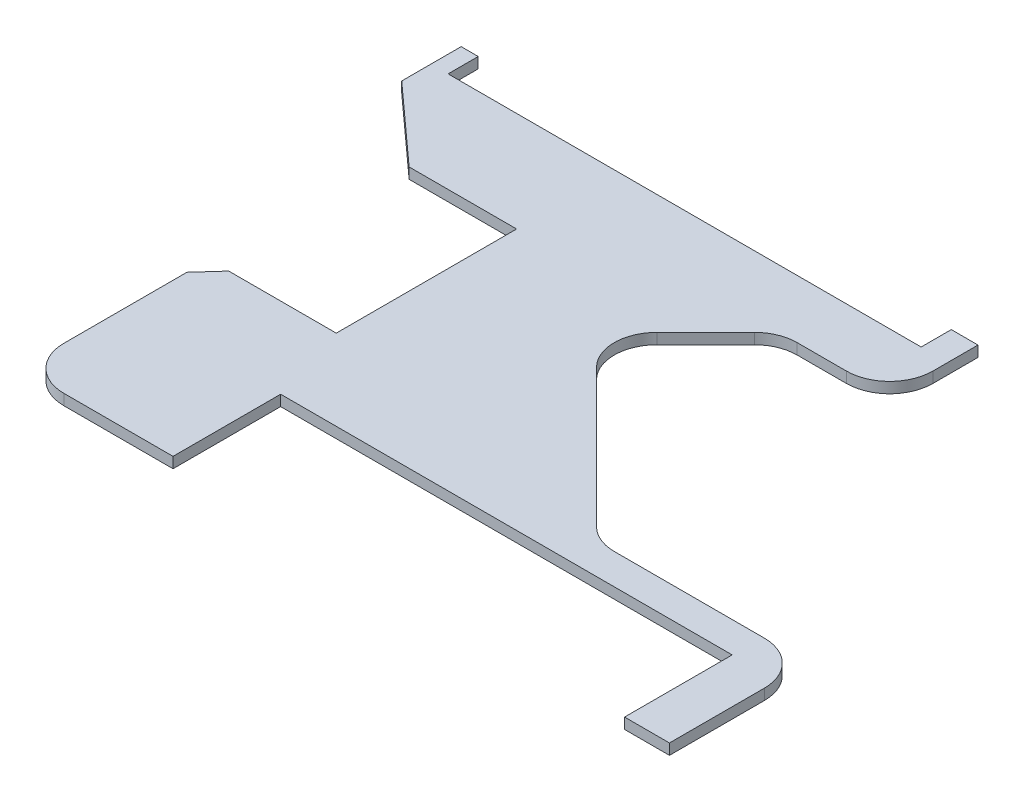
ISO-10303-21;
HEADER;
FILE_DESCRIPTION(('STEP AP214'),'2;1');
FILE_NAME('part.step','',(''),(''),'','','');
FILE_SCHEMA(('AUTOMOTIVE_DESIGN { 1 0 10303 214 1 1 1 1 }'));
ENDSEC;
DATA;
#1=APPLICATION_CONTEXT('core data for automotive mechanical design processes');
#2=APPLICATION_PROTOCOL_DEFINITION('international standard','automotive_design',2000,#1);
#3=PRODUCT_CONTEXT('',#1,'mechanical');
#4=PRODUCT('Part','Part','',(#3));
#5=PRODUCT_RELATED_PRODUCT_CATEGORY('part','',(#4));
#6=PRODUCT_DEFINITION_FORMATION('','',#4);
#7=PRODUCT_DEFINITION_CONTEXT('part definition',#1,'design');
#8=PRODUCT_DEFINITION('design','',#6,#7);
#9=PRODUCT_DEFINITION_SHAPE('','',#8);
#10=(LENGTH_UNIT() NAMED_UNIT(*) SI_UNIT(.MILLI.,.METRE.));
#11=(NAMED_UNIT(*) PLANE_ANGLE_UNIT() SI_UNIT($,.RADIAN.));
#12=(NAMED_UNIT(*) SI_UNIT($,.STERADIAN.) SOLID_ANGLE_UNIT());
#13=UNCERTAINTY_MEASURE_WITH_UNIT(LENGTH_MEASURE(1.E-05),#10,'distance_accuracy_value','');
#14=(GEOMETRIC_REPRESENTATION_CONTEXT(3) GLOBAL_UNCERTAINTY_ASSIGNED_CONTEXT((#13)) GLOBAL_UNIT_ASSIGNED_CONTEXT((#10,
#11,#12)) REPRESENTATION_CONTEXT('',''));
#15=CARTESIAN_POINT('',(0.,0.,0.));
#16=DIRECTION('',(0.,0.,1.));
#17=DIRECTION('',(1.,0.,0.));
#18=AXIS2_PLACEMENT_3D('',#15,#16,#17);
#19=CARTESIAN_POINT('',(-149.633756095351,6.35,-116.560985612658));
#20=DIRECTION('',(0.671096805724453,0.,-0.74136973053021));
#21=DIRECTION('',(-0.74136973053021,0.,-0.671096805724453));
#22=AXIS2_PLACEMENT_3D('',#19,#20,#21);
#23=PLANE('',#22);
#24=DIRECTION('',(0.74136973053021,0.,0.671096805724453));
#25=VECTOR('',#24,1.);
#26=CARTESIAN_POINT('',(-149.633756095351,0.,-116.560985612658));
#27=LINE('',#26,#25);
#28=CARTESIAN_POINT('',(-149.633756095351,0.,-116.560985612658));
#29=VERTEX_POINT('',#28);
#30=CARTESIAN_POINT('',(-103.503143824412,0.,-74.803));
#31=VERTEX_POINT('',#30);
#32=EDGE_CURVE('E255',#29,#31,#27,.T.);
#33=ORIENTED_EDGE('',*,*,#32,.T.);
#34=DIRECTION('',(0.,-1.,0.));
#35=VECTOR('',#34,1.);
#36=CARTESIAN_POINT('',(-103.503143824412,6.35,-74.803));
#37=LINE('',#36,#35);
#38=CARTESIAN_POINT('',(-103.503143824412,6.35,-74.803));
#39=VERTEX_POINT('',#38);
#40=EDGE_CURVE('E11',#39,#31,#37,.T.);
#41=ORIENTED_EDGE('',*,*,#40,.F.);
#42=DIRECTION('',(0.74136973053021,0.,0.671096805724453));
#43=VECTOR('',#42,1.);
#44=CARTESIAN_POINT('',(-149.633756095351,6.35,-116.560985612658));
#45=LINE('',#44,#43);
#46=CARTESIAN_POINT('',(-149.633756095351,6.35,-116.560985612658));
#47=VERTEX_POINT('',#46);
#48=EDGE_CURVE('E150',#47,#39,#45,.T.);
#49=ORIENTED_EDGE('',*,*,#48,.F.);
#50=DIRECTION('',(0.,-1.,0.));
#51=VECTOR('',#50,1.);
#52=CARTESIAN_POINT('',(-149.633756095351,6.35,-116.560985612658));
#53=LINE('',#52,#51);
#54=EDGE_CURVE('E49',#47,#29,#53,.T.);
#55=ORIENTED_EDGE('',*,*,#54,.T.);
#56=EDGE_LOOP('',(#33,#41,#49,#55));
#57=FACE_BOUND('',#56,.T.);
#58=ADVANCED_FACE('F33',(#57),#23,.F.);
#59=CARTESIAN_POINT('',(-40.0812,6.35,-74.803));
#60=DIRECTION('',(0.,0.,1.));
#61=DIRECTION('',(1.,0.,0.));
#62=AXIS2_PLACEMENT_3D('',#59,#60,#61);
#63=PLANE('',#62);
#64=DIRECTION('',(-1.,0.,0.));
#65=VECTOR('',#64,1.);
#66=CARTESIAN_POINT('',(-40.0812,0.,-74.803));
#67=LINE('',#66,#65);
#68=CARTESIAN_POINT('',(-40.0812,0.,-74.803));
#69=VERTEX_POINT('',#68);
#70=EDGE_CURVE('E257',#69,#31,#67,.T.);
#71=ORIENTED_EDGE('',*,*,#70,.F.);
#72=DIRECTION('',(0.,-1.,0.));
#73=VECTOR('',#72,1.);
#74=CARTESIAN_POINT('',(-40.0812,6.35,-74.803));
#75=LINE('',#74,#73);
#76=CARTESIAN_POINT('',(-40.0812,6.35,-74.803));
#77=VERTEX_POINT('',#76);
#78=EDGE_CURVE('E41',#77,#69,#75,.T.);
#79=ORIENTED_EDGE('',*,*,#78,.F.);
#80=DIRECTION('',(-1.,0.,0.));
#81=VECTOR('',#80,1.);
#82=CARTESIAN_POINT('',(-40.0812,6.35,-74.803));
#83=LINE('',#82,#81);
#84=EDGE_CURVE('E413',#77,#39,#83,.T.);
#85=ORIENTED_EDGE('',*,*,#84,.T.);
#86=ORIENTED_EDGE('',*,*,#40,.T.);
#87=EDGE_LOOP('',(#71,#79,#85,#86));
#88=FACE_BOUND('',#87,.T.);
#89=ADVANCED_FACE('F396',(#88),#63,.T.);
#90=CARTESIAN_POINT('',(-40.0812,6.35,0.));
#91=DIRECTION('',(1.,0.,0.));
#92=DIRECTION('',(0.,0.,-1.));
#93=AXIS2_PLACEMENT_3D('',#90,#91,#92);
#94=PLANE('',#93);
#95=DIRECTION('',(0.,0.,1.));
#96=VECTOR('',#95,1.);
#97=CARTESIAN_POINT('',(-40.0812,0.,0.));
#98=LINE('',#97,#96);
#99=CARTESIAN_POINT('',(-40.0812,0.,31.623));
#100=VERTEX_POINT('',#99);
#101=EDGE_CURVE('E260',#69,#100,#98,.T.);
#102=ORIENTED_EDGE('',*,*,#101,.T.);
#103=DIRECTION('',(0.,-1.,0.));
#104=VECTOR('',#103,1.);
#105=CARTESIAN_POINT('',(-40.0812,6.35,31.623));
#106=LINE('',#105,#104);
#107=CARTESIAN_POINT('',(-40.0812,6.35,31.623));
#108=VERTEX_POINT('',#107);
#109=EDGE_CURVE('E385',#108,#100,#106,.T.);
#110=ORIENTED_EDGE('',*,*,#109,.F.);
#111=DIRECTION('',(0.,0.,-1.));
#112=VECTOR('',#111,1.);
#113=CARTESIAN_POINT('',(-40.0812,6.35,0.));
#114=LINE('',#113,#112);
#115=EDGE_CURVE('E393',#108,#77,#114,.T.);
#116=ORIENTED_EDGE('',*,*,#115,.T.);
#117=ORIENTED_EDGE('',*,*,#78,.T.);
#118=EDGE_LOOP('',(#102,#110,#116,#117));
#119=FACE_BOUND('',#118,.T.);
#120=ADVANCED_FACE('F391',(#119),#94,.F.);
#121=CARTESIAN_POINT('',(-40.0812,6.35,31.623));
#122=DIRECTION('',(0.,0.,1.));
#123=DIRECTION('',(1.,0.,0.));
#124=AXIS2_PLACEMENT_3D('',#121,#122,#123);
#125=PLANE('',#124);
#126=DIRECTION('',(-1.,0.,0.));
#127=VECTOR('',#126,1.);
#128=CARTESIAN_POINT('',(-40.0812,0.,31.623));
#129=LINE('',#128,#127);
#130=CARTESIAN_POINT('',(-103.510542610108,0.,31.623));
#131=VERTEX_POINT('',#130);
#132=EDGE_CURVE('E262',#100,#131,#129,.T.);
#133=ORIENTED_EDGE('',*,*,#132,.T.);
#134=DIRECTION('',(0.,-1.,0.));
#135=VECTOR('',#134,1.);
#136=CARTESIAN_POINT('',(-103.510542610108,6.35,31.623));
#137=LINE('',#136,#135);
#138=CARTESIAN_POINT('',(-103.510542610108,6.35,31.623));
#139=VERTEX_POINT('',#138);
#140=EDGE_CURVE('E383',#139,#131,#137,.T.);
#141=ORIENTED_EDGE('',*,*,#140,.F.);
#142=DIRECTION('',(-1.,0.,0.));
#143=VECTOR('',#142,1.);
#144=CARTESIAN_POINT('',(-40.0812,6.35,31.623));
#145=LINE('',#144,#143);
#146=EDGE_CURVE('E407',#108,#139,#145,.T.);
#147=ORIENTED_EDGE('',*,*,#146,.F.);
#148=ORIENTED_EDGE('',*,*,#109,.T.);
#149=EDGE_LOOP('',(#133,#141,#147,#148));
#150=FACE_BOUND('',#149,.T.);
#151=ADVANCED_FACE('F404',(#150),#125,.F.);
#152=CARTESIAN_POINT('',(-115.248716587259,6.35,44.5903197728351));
#153=DIRECTION('',(-0.741369730530207,0.,-0.671096805724455));
#154=DIRECTION('',(-0.671096805724456,0.,0.741369730530207));
#155=AXIS2_PLACEMENT_3D('',#152,#153,#154);
#156=PLANE('',#155);
#157=DIRECTION('',(0.671096805724456,0.,-0.741369730530207));
#158=VECTOR('',#157,1.);
#159=CARTESIAN_POINT('',(-115.248716587259,0.,44.5903197728351));
#160=LINE('',#159,#158);
#161=CARTESIAN_POINT('',(-115.248716587259,0.,44.5903197728351));
#162=VERTEX_POINT('',#161);
#163=EDGE_CURVE('E265',#162,#131,#160,.T.);
#164=ORIENTED_EDGE('',*,*,#163,.F.);
#165=DIRECTION('',(0.,-1.,0.));
#166=VECTOR('',#165,1.);
#167=CARTESIAN_POINT('',(-115.248716587259,6.35,44.5903197728351));
#168=LINE('',#167,#166);
#169=CARTESIAN_POINT('',(-115.248716587259,6.35,44.5903197728351));
#170=VERTEX_POINT('',#169);
#171=EDGE_CURVE('E381',#170,#162,#168,.T.);
#172=ORIENTED_EDGE('',*,*,#171,.F.);
#173=DIRECTION('',(0.671096805724456,0.,-0.741369730530207));
#174=VECTOR('',#173,1.);
#175=CARTESIAN_POINT('',(-115.248716587259,6.35,44.5903197728351));
#176=LINE('',#175,#174);
#177=EDGE_CURVE('E409',#170,#139,#176,.T.);
#178=ORIENTED_EDGE('',*,*,#177,.T.);
#179=ORIENTED_EDGE('',*,*,#140,.T.);
#180=EDGE_LOOP('',(#164,#172,#178,#179));
#181=FACE_BOUND('',#180,.T.);
#182=ADVANCED_FACE('F494',(#181),#156,.T.);
#183=CARTESIAN_POINT('',(-115.248716587259,6.35,44.5903197728351));
#184=DIRECTION('',(1.,0.,0.));
#185=DIRECTION('',(0.,0.,-1.));
#186=AXIS2_PLACEMENT_3D('',#183,#184,#185);
#187=PLANE('',#186);
#188=DIRECTION('',(0.,0.,1.));
#189=VECTOR('',#188,1.);
#190=CARTESIAN_POINT('',(-115.248716587259,0.,44.5903197728351));
#191=LINE('',#190,#189);
#192=CARTESIAN_POINT('',(-115.248716587259,0.,117.221));
#193=VERTEX_POINT('',#192);
#194=EDGE_CURVE('E268',#162,#193,#191,.T.);
#195=ORIENTED_EDGE('',*,*,#194,.T.);
#196=DIRECTION('',(0.,-1.,0.));
#197=VECTOR('',#196,1.);
#198=CARTESIAN_POINT('',(-115.248716587259,6.35,117.221));
#199=LINE('',#198,#197);
#200=CARTESIAN_POINT('',(-115.248716587259,6.35,117.221));
#201=VERTEX_POINT('',#200);
#202=EDGE_CURVE('E379',#201,#193,#199,.T.);
#203=ORIENTED_EDGE('',*,*,#202,.F.);
#204=DIRECTION('',(0.,0.,1.));
#205=VECTOR('',#204,1.);
#206=CARTESIAN_POINT('',(-115.248716587259,6.35,44.5903197728351));
#207=LINE('',#206,#205);
#208=EDGE_CURVE('E411',#170,#201,#207,.T.);
#209=ORIENTED_EDGE('',*,*,#208,.F.);
#210=ORIENTED_EDGE('',*,*,#171,.T.);
#211=EDGE_LOOP('',(#195,#203,#209,#210));
#212=FACE_BOUND('',#211,.T.);
#213=ADVANCED_FACE('F497',(#212),#187,.F.);
#214=CARTESIAN_POINT('',(-89.7217165872589,6.35,117.221));
#215=DIRECTION('',(0.,-1.,0.));
#216=DIRECTION('',(0.,0.,-1.));
#217=AXIS2_PLACEMENT_3D('',#214,#215,#216);
#218=CYLINDRICAL_SURFACE('',#217,25.527);
#219=CARTESIAN_POINT('',(-89.7217165872589,0.,117.221));
#220=DIRECTION('',(0.,-1.,0.));
#221=DIRECTION('',(0.,0.,-1.));
#222=AXIS2_PLACEMENT_3D('',#219,#220,#221);
#223=CIRCLE('',#222,25.527);
#224=CARTESIAN_POINT('',(-89.7217165872589,0.,142.748));
#225=VERTEX_POINT('',#224);
#226=EDGE_CURVE('E271',#225,#193,#223,.T.);
#227=ORIENTED_EDGE('',*,*,#226,.F.);
#228=DIRECTION('',(0.,-1.,0.));
#229=VECTOR('',#228,1.);
#230=CARTESIAN_POINT('',(-89.7217165872589,6.35,142.748));
#231=LINE('',#230,#229);
#232=CARTESIAN_POINT('',(-89.7217165872589,6.35,142.748));
#233=VERTEX_POINT('',#232);
#234=EDGE_CURVE('E377',#233,#225,#231,.T.);
#235=ORIENTED_EDGE('',*,*,#234,.F.);
#236=CARTESIAN_POINT('',(-89.7217165872589,6.35,117.221));
#237=DIRECTION('',(0.,-1.,0.));
#238=DIRECTION('',(0.,0.,-1.));
#239=AXIS2_PLACEMENT_3D('',#236,#237,#238);
#240=CIRCLE('',#239,25.527);
#241=EDGE_CURVE('E418',#233,#201,#240,.T.);
#242=ORIENTED_EDGE('',*,*,#241,.T.);
#243=ORIENTED_EDGE('',*,*,#202,.T.);
#244=EDGE_LOOP('',(#227,#235,#242,#243));
#245=FACE_BOUND('',#244,.T.);
#246=ADVANCED_FACE('F501',(#245),#218,.T.);
#247=CARTESIAN_POINT('',(-89.7217165872589,6.35,142.748));
#248=DIRECTION('',(0.,0.,-1.));
#249=DIRECTION('',(-1.,0.,0.));
#250=AXIS2_PLACEMENT_3D('',#247,#248,#249);
#251=PLANE('',#250);
#252=DIRECTION('',(1.,0.,0.));
#253=VECTOR('',#252,1.);
#254=CARTESIAN_POINT('',(-89.7217165872589,0.,142.748));
#255=LINE('',#254,#253);
#256=CARTESIAN_POINT('',(-25.273,0.,142.748));
#257=VERTEX_POINT('',#256);
#258=EDGE_CURVE('E274',#225,#257,#255,.T.);
#259=ORIENTED_EDGE('',*,*,#258,.T.);
#260=DIRECTION('',(0.,-1.,0.));
#261=VECTOR('',#260,1.);
#262=CARTESIAN_POINT('',(-25.273,6.35,142.748));
#263=LINE('',#262,#261);
#264=CARTESIAN_POINT('',(-25.273,6.35,142.748));
#265=VERTEX_POINT('',#264);
#266=EDGE_CURVE('E375',#265,#257,#263,.T.);
#267=ORIENTED_EDGE('',*,*,#266,.F.);
#268=DIRECTION('',(1.,0.,0.));
#269=VECTOR('',#268,1.);
#270=CARTESIAN_POINT('',(-89.7217165872589,6.35,142.748));
#271=LINE('',#270,#269);
#272=EDGE_CURVE('E421',#233,#265,#271,.T.);
#273=ORIENTED_EDGE('',*,*,#272,.F.);
#274=ORIENTED_EDGE('',*,*,#234,.T.);
#275=EDGE_LOOP('',(#259,#267,#273,#274));
#276=FACE_BOUND('',#275,.T.);
#277=ADVANCED_FACE('F505',(#276),#251,.F.);
#278=CARTESIAN_POINT('',(-25.273,6.35,79.248));
#279=DIRECTION('',(1.,0.,0.));
#280=DIRECTION('',(0.,0.,-1.));
#281=AXIS2_PLACEMENT_3D('',#278,#279,#280);
#282=PLANE('',#281);
#283=DIRECTION('',(0.,0.,1.));
#284=VECTOR('',#283,1.);
#285=CARTESIAN_POINT('',(-25.273,0.,79.248));
#286=LINE('',#285,#284);
#287=CARTESIAN_POINT('',(-25.273,0.,79.248));
#288=VERTEX_POINT('',#287);
#289=EDGE_CURVE('E277',#288,#257,#286,.T.);
#290=ORIENTED_EDGE('',*,*,#289,.F.);
#291=DIRECTION('',(0.,-1.,0.));
#292=VECTOR('',#291,1.);
#293=CARTESIAN_POINT('',(-25.273,6.35,79.248));
#294=LINE('',#293,#292);
#295=CARTESIAN_POINT('',(-25.273,6.35,79.248));
#296=VERTEX_POINT('',#295);
#297=EDGE_CURVE('E372',#296,#288,#294,.T.);
#298=ORIENTED_EDGE('',*,*,#297,.F.);
#299=DIRECTION('',(0.,0.,1.));
#300=VECTOR('',#299,1.);
#301=CARTESIAN_POINT('',(-25.273,6.35,79.248));
#302=LINE('',#301,#300);
#303=EDGE_CURVE('E423',#296,#265,#302,.T.);
#304=ORIENTED_EDGE('',*,*,#303,.T.);
#305=ORIENTED_EDGE('',*,*,#266,.T.);
#306=EDGE_LOOP('',(#290,#298,#304,#305));
#307=FACE_BOUND('',#306,.T.);
#308=ADVANCED_FACE('F509',(#307),#282,.T.);
#309=CARTESIAN_POINT('',(0.,6.35,79.248));
#310=DIRECTION('',(0.,0.,-1.));
#311=DIRECTION('',(-1.,0.,0.));
#312=AXIS2_PLACEMENT_3D('',#309,#310,#311);
#313=PLANE('',#312);
#314=DIRECTION('',(1.,0.,0.));
#315=VECTOR('',#314,1.);
#316=CARTESIAN_POINT('',(0.,0.,79.248));
#317=LINE('',#316,#315);
#318=CARTESIAN_POINT('',(241.173,0.,79.2479999999999));
#319=VERTEX_POINT('',#318);
#320=EDGE_CURVE('E280',#288,#319,#317,.T.);
#321=ORIENTED_EDGE('',*,*,#320,.T.);
#322=DIRECTION('',(0.,-1.,0.));
#323=VECTOR('',#322,1.);
#324=CARTESIAN_POINT('',(241.173,6.35,79.2479999999999));
#325=LINE('',#324,#323);
#326=CARTESIAN_POINT('',(241.173,6.35,79.2479999999999));
#327=VERTEX_POINT('',#326);
#328=EDGE_CURVE('E369',#327,#319,#325,.T.);
#329=ORIENTED_EDGE('',*,*,#328,.F.);
#330=DIRECTION('',(-1.,0.,0.));
#331=VECTOR('',#330,1.);
#332=CARTESIAN_POINT('',(0.,6.35,79.248));
#333=LINE('',#332,#331);
#334=EDGE_CURVE('E426',#327,#296,#333,.T.);
#335=ORIENTED_EDGE('',*,*,#334,.T.);
#336=ORIENTED_EDGE('',*,*,#297,.T.);
#337=EDGE_LOOP('',(#321,#329,#335,#336));
#338=FACE_BOUND('',#337,.T.);
#339=ADVANCED_FACE('F513',(#338),#313,.F.);
#340=CARTESIAN_POINT('',(241.173,6.35,79.2479999999999));
#341=DIRECTION('',(1.,0.,0.));
#342=DIRECTION('',(0.,0.,-1.));
#343=AXIS2_PLACEMENT_3D('',#340,#341,#342);
#344=PLANE('',#343);
#345=DIRECTION('',(0.,0.,1.));
#346=VECTOR('',#345,1.);
#347=CARTESIAN_POINT('',(241.173,0.,79.2479999999999));
#348=LINE('',#347,#346);
#349=CARTESIAN_POINT('',(241.173,0.,142.748));
#350=VERTEX_POINT('',#349);
#351=EDGE_CURVE('E282',#319,#350,#348,.T.);
#352=ORIENTED_EDGE('',*,*,#351,.T.);
#353=DIRECTION('',(0.,-1.,0.));
#354=VECTOR('',#353,1.);
#355=CARTESIAN_POINT('',(241.173,6.35,142.748));
#356=LINE('',#355,#354);
#357=CARTESIAN_POINT('',(241.173,6.35,142.748));
#358=VERTEX_POINT('',#357);
#359=EDGE_CURVE('E367',#358,#350,#356,.T.);
#360=ORIENTED_EDGE('',*,*,#359,.F.);
#361=DIRECTION('',(0.,0.,1.));
#362=VECTOR('',#361,1.);
#363=CARTESIAN_POINT('',(241.173,6.35,79.2479999999999));
#364=LINE('',#363,#362);
#365=EDGE_CURVE('E429',#327,#358,#364,.T.);
#366=ORIENTED_EDGE('',*,*,#365,.F.);
#367=ORIENTED_EDGE('',*,*,#328,.T.);
#368=EDGE_LOOP('',(#352,#360,#366,#367));
#369=FACE_BOUND('',#368,.T.);
#370=ADVANCED_FACE('F517',(#369),#344,.F.);
#371=CARTESIAN_POINT('',(267.652928411668,6.35,142.748));
#372=DIRECTION('',(0.,0.,1.));
#373=DIRECTION('',(1.,0.,0.));
#374=AXIS2_PLACEMENT_3D('',#371,#372,#373);
#375=PLANE('',#374);
#376=DIRECTION('',(-1.,0.,0.));
#377=VECTOR('',#376,1.);
#378=CARTESIAN_POINT('',(267.652928411668,0.,142.748));
#379=LINE('',#378,#377);
#380=CARTESIAN_POINT('',(267.652928411668,0.,142.748));
#381=VERTEX_POINT('',#380);
#382=EDGE_CURVE('E285',#381,#350,#379,.T.);
#383=ORIENTED_EDGE('',*,*,#382,.F.);
#384=DIRECTION('',(0.,-1.,0.));
#385=VECTOR('',#384,1.);
#386=CARTESIAN_POINT('',(267.652928411668,6.35,142.748));
#387=LINE('',#386,#385);
#388=CARTESIAN_POINT('',(267.652928411668,6.35,142.748));
#389=VERTEX_POINT('',#388);
#390=EDGE_CURVE('E365',#389,#381,#387,.T.);
#391=ORIENTED_EDGE('',*,*,#390,.F.);
#392=DIRECTION('',(-1.,0.,0.));
#393=VECTOR('',#392,1.);
#394=CARTESIAN_POINT('',(267.652928411668,6.35,142.748));
#395=LINE('',#394,#393);
#396=EDGE_CURVE('E431',#389,#358,#395,.T.);
#397=ORIENTED_EDGE('',*,*,#396,.T.);
#398=ORIENTED_EDGE('',*,*,#359,.T.);
#399=EDGE_LOOP('',(#383,#391,#397,#398));
#400=FACE_BOUND('',#399,.T.);
#401=ADVANCED_FACE('F521',(#400),#375,.T.);
#402=CARTESIAN_POINT('',(267.652928411668,6.35,86.6996844655744));
#403=DIRECTION('',(1.,0.,0.));
#404=DIRECTION('',(0.,0.,-1.));
#405=AXIS2_PLACEMENT_3D('',#402,#403,#404);
#406=PLANE('',#405);
#407=DIRECTION('',(0.,0.,1.));
#408=VECTOR('',#407,1.);
#409=CARTESIAN_POINT('',(267.652928411668,0.,86.6996844655744));
#410=LINE('',#409,#408);
#411=CARTESIAN_POINT('',(267.652928411668,0.,86.6996844655744));
#412=VERTEX_POINT('',#411);
#413=EDGE_CURVE('E288',#412,#381,#410,.T.);
#414=ORIENTED_EDGE('',*,*,#413,.F.);
#415=DIRECTION('',(0.,-1.,0.));
#416=VECTOR('',#415,1.);
#417=CARTESIAN_POINT('',(267.652928411668,6.35,86.6996844655744));
#418=LINE('',#417,#416);
#419=CARTESIAN_POINT('',(267.652928411668,6.35,86.6996844655744));
#420=VERTEX_POINT('',#419);
#421=EDGE_CURVE('E363',#420,#412,#418,.T.);
#422=ORIENTED_EDGE('',*,*,#421,.F.);
#423=DIRECTION('',(0.,0.,1.));
#424=VECTOR('',#423,1.);
#425=CARTESIAN_POINT('',(267.652928411668,6.35,86.6996844655744));
#426=LINE('',#425,#424);
#427=EDGE_CURVE('E434',#420,#389,#426,.T.);
#428=ORIENTED_EDGE('',*,*,#427,.T.);
#429=ORIENTED_EDGE('',*,*,#390,.T.);
#430=EDGE_LOOP('',(#414,#422,#428,#429));
#431=FACE_BOUND('',#430,.T.);
#432=ADVANCED_FACE('F525',(#431),#406,.T.);
#433=CARTESIAN_POINT('',(242.125928411668,6.35,86.6996844655744));
#434=DIRECTION('',(0.,-1.,0.));
#435=DIRECTION('',(0.,0.,-1.));
#436=AXIS2_PLACEMENT_3D('',#433,#434,#435);
#437=CYLINDRICAL_SURFACE('',#436,25.527);
#438=CARTESIAN_POINT('',(242.125928411668,0.,86.6996844655744));
#439=DIRECTION('',(0.,-1.,0.));
#440=DIRECTION('',(0.,0.,-1.));
#441=AXIS2_PLACEMENT_3D('',#438,#439,#440);
#442=CIRCLE('',#441,25.527);
#443=CARTESIAN_POINT('',(242.125928411668,0.,61.1726844655745));
#444=VERTEX_POINT('',#443);
#445=EDGE_CURVE('E291',#444,#412,#442,.T.);
#446=ORIENTED_EDGE('',*,*,#445,.F.);
#447=DIRECTION('',(0.,-1.,0.));
#448=VECTOR('',#447,1.);
#449=CARTESIAN_POINT('',(242.125928411668,6.35,61.1726844655745));
#450=LINE('',#449,#448);
#451=CARTESIAN_POINT('',(242.125928411668,6.35,61.1726844655745));
#452=VERTEX_POINT('',#451);
#453=EDGE_CURVE('E361',#452,#444,#450,.T.);
#454=ORIENTED_EDGE('',*,*,#453,.F.);
#455=CARTESIAN_POINT('',(242.125928411668,6.35,86.6996844655744));
#456=DIRECTION('',(0.,-1.,0.));
#457=DIRECTION('',(0.,0.,-1.));
#458=AXIS2_PLACEMENT_3D('',#455,#456,#457);
#459=CIRCLE('',#458,25.527);
#460=EDGE_CURVE('E437',#452,#420,#459,.T.);
#461=ORIENTED_EDGE('',*,*,#460,.T.);
#462=ORIENTED_EDGE('',*,*,#421,.T.);
#463=EDGE_LOOP('',(#446,#454,#461,#462));
#464=FACE_BOUND('',#463,.T.);
#465=ADVANCED_FACE('F529',(#464),#437,.T.);
#466=CARTESIAN_POINT('',(153.509137510121,6.35,61.1726844655744));
#467=DIRECTION('',(0.,0.,-1.));
#468=DIRECTION('',(-1.,0.,0.));
#469=AXIS2_PLACEMENT_3D('',#466,#467,#468);
#470=PLANE('',#469);
#471=DIRECTION('',(1.,0.,0.));
#472=VECTOR('',#471,1.);
#473=CARTESIAN_POINT('',(153.509137510121,0.,61.1726844655744));
#474=LINE('',#473,#472);
#475=CARTESIAN_POINT('',(153.509137510121,0.,61.1726844655744));
#476=VERTEX_POINT('',#475);
#477=EDGE_CURVE('E294',#476,#444,#474,.T.);
#478=ORIENTED_EDGE('',*,*,#477,.F.);
#479=DIRECTION('',(0.,-1.,0.));
#480=VECTOR('',#479,1.);
#481=CARTESIAN_POINT('',(153.509137510121,6.35,61.1726844655744));
#482=LINE('',#481,#480);
#483=CARTESIAN_POINT('',(153.509137510121,6.35,61.1726844655744));
#484=VERTEX_POINT('',#483);
#485=EDGE_CURVE('E359',#484,#476,#482,.T.);
#486=ORIENTED_EDGE('',*,*,#485,.F.);
#487=DIRECTION('',(1.,0.,0.));
#488=VECTOR('',#487,1.);
#489=CARTESIAN_POINT('',(153.509137510121,6.35,61.1726844655744));
#490=LINE('',#489,#488);
#491=EDGE_CURVE('E440',#484,#452,#490,.T.);
#492=ORIENTED_EDGE('',*,*,#491,.T.);
#493=ORIENTED_EDGE('',*,*,#453,.T.);
#494=EDGE_LOOP('',(#478,#486,#492,#493));
#495=FACE_BOUND('',#494,.T.);
#496=ADVANCED_FACE('F533',(#495),#470,.T.);
#497=CARTESIAN_POINT('',(153.509137510121,6.35,35.8996844655744));
#498=DIRECTION('',(0.,-1.,0.));
#499=DIRECTION('',(0.,0.,-1.));
#500=AXIS2_PLACEMENT_3D('',#497,#498,#499);
#501=CYLINDRICAL_SURFACE('',#500,25.273);
#502=CARTESIAN_POINT('',(153.509137510121,0.,35.8996844655744));
#503=DIRECTION('',(0.,1.,0.));
#504=DIRECTION('',(0.,0.,1.));
#505=AXIS2_PLACEMENT_3D('',#502,#503,#504);
#506=CIRCLE('',#505,25.273);
#507=CARTESIAN_POINT('',(135.638427829193,0.,53.770394146502));
#508=VERTEX_POINT('',#507);
#509=EDGE_CURVE('E297',#508,#476,#506,.T.);
#510=ORIENTED_EDGE('',*,*,#509,.F.);
#511=DIRECTION('',(0.,-1.,0.));
#512=VECTOR('',#511,1.);
#513=CARTESIAN_POINT('',(135.638427829193,6.35,53.770394146502));
#514=LINE('',#513,#512);
#515=CARTESIAN_POINT('',(135.638427829193,6.35,53.770394146502));
#516=VERTEX_POINT('',#515);
#517=EDGE_CURVE('E357',#516,#508,#514,.T.);
#518=ORIENTED_EDGE('',*,*,#517,.F.);
#519=CARTESIAN_POINT('',(153.509137510121,6.35,35.8996844655744));
#520=DIRECTION('',(0.,1.,0.));
#521=DIRECTION('',(0.,0.,1.));
#522=AXIS2_PLACEMENT_3D('',#519,#520,#521);
#523=CIRCLE('',#522,25.273);
#524=EDGE_CURVE('E443',#516,#484,#523,.T.);
#525=ORIENTED_EDGE('',*,*,#524,.T.);
#526=ORIENTED_EDGE('',*,*,#485,.T.);
#527=EDGE_LOOP('',(#510,#518,#525,#526));
#528=FACE_BOUND('',#527,.T.);
#529=ADVANCED_FACE('F537',(#528),#501,.F.);
#530=CARTESIAN_POINT('',(54.1803023102504,6.35,-27.687731372441));
#531=DIRECTION('',(0.707106781186547,0.,-0.707106781186548));
#532=DIRECTION('',(-0.707106781186548,0.,-0.707106781186547));
#533=AXIS2_PLACEMENT_3D('',#530,#531,#532);
#534=PLANE('',#533);
#535=DIRECTION('',(0.707106781186548,0.,0.707106781186547));
#536=VECTOR('',#535,1.);
#537=CARTESIAN_POINT('',(54.1803023102504,0.,-27.687731372441));
#538=LINE('',#537,#536);
#539=CARTESIAN_POINT('',(54.1803023102504,0.,-27.687731372441));
#540=VERTEX_POINT('',#539);
#541=EDGE_CURVE('E300',#540,#508,#538,.T.);
#542=ORIENTED_EDGE('',*,*,#541,.F.);
#543=DIRECTION('',(0.,-1.,0.));
#544=VECTOR('',#543,1.);
#545=CARTESIAN_POINT('',(54.1803023102504,6.35,-27.687731372441));
#546=LINE('',#545,#544);
#547=CARTESIAN_POINT('',(54.1803023102504,6.35,-27.687731372441));
#548=VERTEX_POINT('',#547);
#549=EDGE_CURVE('E355',#548,#540,#546,.T.);
#550=ORIENTED_EDGE('',*,*,#549,.F.);
#551=DIRECTION('',(0.707106781186548,0.,0.707106781186547));
#552=VECTOR('',#551,1.);
#553=CARTESIAN_POINT('',(54.1803023102504,6.35,-27.687731372441));
#554=LINE('',#553,#552);
#555=EDGE_CURVE('E446',#548,#516,#554,.T.);
#556=ORIENTED_EDGE('',*,*,#555,.T.);
#557=ORIENTED_EDGE('',*,*,#517,.T.);
#558=EDGE_LOOP('',(#542,#550,#556,#557));
#559=FACE_BOUND('',#558,.T.);
#560=ADVANCED_FACE('F541',(#559),#534,.T.);
#561=CARTESIAN_POINT('',(72.051011991178,6.35,-45.5584410533686));
#562=DIRECTION('',(0.,-1.,0.));
#563=DIRECTION('',(0.,0.,-1.));
#564=AXIS2_PLACEMENT_3D('',#561,#562,#563);
#565=CYLINDRICAL_SURFACE('',#564,25.273);
#566=CARTESIAN_POINT('',(72.051011991178,0.,-45.5584410533686));
#567=DIRECTION('',(0.,-1.,0.));
#568=DIRECTION('',(0.,0.,-1.));
#569=AXIS2_PLACEMENT_3D('',#566,#567,#568);
#570=CIRCLE('',#569,25.273);
#571=CARTESIAN_POINT('',(54.1803023102504,0.,-63.4291507342962));
#572=VERTEX_POINT('',#571);
#573=EDGE_CURVE('E303',#540,#572,#570,.T.);
#574=ORIENTED_EDGE('',*,*,#573,.T.);
#575=DIRECTION('',(0.,-1.,0.));
#576=VECTOR('',#575,1.);
#577=CARTESIAN_POINT('',(54.1803023102504,6.35,-63.4291507342962));
#578=LINE('',#577,#576);
#579=CARTESIAN_POINT('',(54.1803023102504,6.35,-63.4291507342962));
#580=VERTEX_POINT('',#579);
#581=EDGE_CURVE('E353',#580,#572,#578,.T.);
#582=ORIENTED_EDGE('',*,*,#581,.F.);
#583=CARTESIAN_POINT('',(72.051011991178,6.35,-45.5584410533686));
#584=DIRECTION('',(0.,-1.,0.));
#585=DIRECTION('',(0.,0.,-1.));
#586=AXIS2_PLACEMENT_3D('',#583,#584,#585);
#587=CIRCLE('',#586,25.273);
#588=EDGE_CURVE('E449',#548,#580,#587,.T.);
#589=ORIENTED_EDGE('',*,*,#588,.F.);
#590=ORIENTED_EDGE('',*,*,#549,.T.);
#591=EDGE_LOOP('',(#574,#582,#589,#590));
#592=FACE_BOUND('',#591,.T.);
#593=ADVANCED_FACE('F545',(#592),#565,.F.);
#594=CARTESIAN_POINT('',(82.8593536677691,6.35,-92.1082020918148));
#595=DIRECTION('',(0.707106781186547,0.,0.707106781186548));
#596=DIRECTION('',(0.707106781186548,0.,-0.707106781186547));
#597=AXIS2_PLACEMENT_3D('',#594,#595,#596);
#598=PLANE('',#597);
#599=DIRECTION('',(-0.707106781186548,0.,0.707106781186547));
#600=VECTOR('',#599,1.);
#601=CARTESIAN_POINT('',(82.8593536677691,0.,-92.1082020918148));
#602=LINE('',#601,#600);
#603=CARTESIAN_POINT('',(82.8593536677691,0.,-92.1082020918148));
#604=VERTEX_POINT('',#603);
#605=EDGE_CURVE('E306',#604,#572,#602,.T.);
#606=ORIENTED_EDGE('',*,*,#605,.F.);
#607=DIRECTION('',(0.,-1.,0.));
#608=VECTOR('',#607,1.);
#609=CARTESIAN_POINT('',(82.8593536677691,6.35,-92.1082020918148));
#610=LINE('',#609,#608);
#611=CARTESIAN_POINT('',(82.8593536677691,6.35,-92.1082020918148));
#612=VERTEX_POINT('',#611);
#613=EDGE_CURVE('E351',#612,#604,#610,.T.);
#614=ORIENTED_EDGE('',*,*,#613,.F.);
#615=DIRECTION('',(-0.707106781186548,0.,0.707106781186547));
#616=VECTOR('',#615,1.);
#617=CARTESIAN_POINT('',(82.8593536677691,6.35,-92.1082020918148));
#618=LINE('',#617,#616);
#619=EDGE_CURVE('E451',#612,#580,#618,.T.);
#620=ORIENTED_EDGE('',*,*,#619,.T.);
#621=ORIENTED_EDGE('',*,*,#581,.T.);
#622=EDGE_LOOP('',(#606,#614,#620,#621));
#623=FACE_BOUND('',#622,.T.);
#624=ADVANCED_FACE('F549',(#623),#598,.T.);
#625=CARTESIAN_POINT('',(100.730063348697,6.35,-74.2374924108872));
#626=DIRECTION('',(0.,-1.,0.));
#627=DIRECTION('',(0.,0.,-1.));
#628=AXIS2_PLACEMENT_3D('',#625,#626,#627);
#629=CYLINDRICAL_SURFACE('',#628,25.273);
#630=CARTESIAN_POINT('',(100.730063348697,0.,-74.2374924108872));
#631=DIRECTION('',(0.,1.,0.));
#632=DIRECTION('',(0.,0.,1.));
#633=AXIS2_PLACEMENT_3D('',#630,#631,#632);
#634=CIRCLE('',#633,25.273);
#635=CARTESIAN_POINT('',(100.730063348697,0.,-99.5104924108872));
#636=VERTEX_POINT('',#635);
#637=EDGE_CURVE('E309',#636,#604,#634,.T.);
#638=ORIENTED_EDGE('',*,*,#637,.F.);
#639=DIRECTION('',(0.,-1.,0.));
#640=VECTOR('',#639,1.);
#641=CARTESIAN_POINT('',(100.730063348697,6.35,-99.5104924108872));
#642=LINE('',#641,#640);
#643=CARTESIAN_POINT('',(100.730063348697,6.35,-99.5104924108872));
#644=VERTEX_POINT('',#643);
#645=EDGE_CURVE('E349',#644,#636,#642,.T.);
#646=ORIENTED_EDGE('',*,*,#645,.F.);
#647=CARTESIAN_POINT('',(100.730063348697,6.35,-74.2374924108872));
#648=DIRECTION('',(0.,1.,0.));
#649=DIRECTION('',(0.,0.,1.));
#650=AXIS2_PLACEMENT_3D('',#647,#648,#649);
#651=CIRCLE('',#650,25.273);
#652=EDGE_CURVE('E454',#644,#612,#651,.T.);
#653=ORIENTED_EDGE('',*,*,#652,.T.);
#654=ORIENTED_EDGE('',*,*,#613,.T.);
#655=EDGE_LOOP('',(#638,#646,#653,#654));
#656=FACE_BOUND('',#655,.T.);
#657=ADVANCED_FACE('F553',(#656),#629,.F.);
#658=CARTESIAN_POINT('',(100.730063348697,6.35,-99.5104924108872));
#659=DIRECTION('',(0.,0.,-1.));
#660=DIRECTION('',(-1.,0.,0.));
#661=AXIS2_PLACEMENT_3D('',#658,#659,#660);
#662=PLANE('',#661);
#663=DIRECTION('',(1.,0.,0.));
#664=VECTOR('',#663,1.);
#665=CARTESIAN_POINT('',(100.730063348697,0.,-99.5104924108872));
#666=LINE('',#665,#664);
#667=CARTESIAN_POINT('',(129.80789866913,0.,-99.5104924108872));
#668=VERTEX_POINT('',#667);
#669=EDGE_CURVE('E312',#636,#668,#666,.T.);
#670=ORIENTED_EDGE('',*,*,#669,.T.);
#671=DIRECTION('',(0.,-1.,0.));
#672=VECTOR('',#671,1.);
#673=CARTESIAN_POINT('',(129.80789866913,6.35,-99.5104924108872));
#674=LINE('',#673,#672);
#675=CARTESIAN_POINT('',(129.80789866913,6.35,-99.5104924108872));
#676=VERTEX_POINT('',#675);
#677=EDGE_CURVE('E346',#676,#668,#674,.T.);
#678=ORIENTED_EDGE('',*,*,#677,.F.);
#679=DIRECTION('',(1.,0.,0.));
#680=VECTOR('',#679,1.);
#681=CARTESIAN_POINT('',(100.730063348697,6.35,-99.5104924108872));
#682=LINE('',#681,#680);
#683=EDGE_CURVE('E457',#644,#676,#682,.T.);
#684=ORIENTED_EDGE('',*,*,#683,.F.);
#685=ORIENTED_EDGE('',*,*,#645,.T.);
#686=EDGE_LOOP('',(#670,#678,#684,#685));
#687=FACE_BOUND('',#686,.T.);
#688=ADVANCED_FACE('F557',(#687),#662,.F.);
#689=CARTESIAN_POINT('',(129.80789866913,6.35,-125.037492410887));
#690=DIRECTION('',(0.,-1.,0.));
#691=DIRECTION('',(0.,0.,-1.));
#692=AXIS2_PLACEMENT_3D('',#689,#690,#691);
#693=CYLINDRICAL_SURFACE('',#692,25.527);
#694=CARTESIAN_POINT('',(129.80789866913,0.,-125.037492410887));
#695=DIRECTION('',(0.,1.,0.));
#696=DIRECTION('',(0.,0.,1.));
#697=AXIS2_PLACEMENT_3D('',#694,#695,#696);
#698=CIRCLE('',#697,25.527);
#699=CARTESIAN_POINT('',(155.33489866913,0.,-125.037492410887));
#700=VERTEX_POINT('',#699);
#701=EDGE_CURVE('E314',#668,#700,#698,.T.);
#702=ORIENTED_EDGE('',*,*,#701,.T.);
#703=DIRECTION('',(0.,-1.,0.));
#704=VECTOR('',#703,1.);
#705=CARTESIAN_POINT('',(155.33489866913,6.35,-125.037492410887));
#706=LINE('',#705,#704);
#707=CARTESIAN_POINT('',(155.33489866913,6.35,-125.037492410887));
#708=VERTEX_POINT('',#707);
#709=EDGE_CURVE('E344',#708,#700,#706,.T.);
#710=ORIENTED_EDGE('',*,*,#709,.F.);
#711=CARTESIAN_POINT('',(129.80789866913,6.35,-125.037492410887));
#712=DIRECTION('',(0.,1.,0.));
#713=DIRECTION('',(0.,0.,1.));
#714=AXIS2_PLACEMENT_3D('',#711,#712,#713);
#715=CIRCLE('',#714,25.527);
#716=EDGE_CURVE('E459',#676,#708,#715,.T.);
#717=ORIENTED_EDGE('',*,*,#716,.F.);
#718=ORIENTED_EDGE('',*,*,#677,.T.);
#719=EDGE_LOOP('',(#702,#710,#717,#718));
#720=FACE_BOUND('',#719,.T.);
#721=ADVANCED_FACE('F561',(#720),#693,.T.);
#722=CARTESIAN_POINT('',(155.33489866913,6.35,-151.638));
#723=DIRECTION('',(1.,0.,0.));
#724=DIRECTION('',(0.,0.,-1.));
#725=AXIS2_PLACEMENT_3D('',#722,#723,#724);
#726=PLANE('',#725);
#727=DIRECTION('',(0.,0.,1.));
#728=VECTOR('',#727,1.);
#729=CARTESIAN_POINT('',(155.33489866913,0.,-151.638));
#730=LINE('',#729,#728);
#731=CARTESIAN_POINT('',(155.33489866913,0.,-151.638));
#732=VERTEX_POINT('',#731);
#733=EDGE_CURVE('E317',#732,#700,#730,.T.);
#734=ORIENTED_EDGE('',*,*,#733,.F.);
#735=DIRECTION('',(0.,-1.,0.));
#736=VECTOR('',#735,1.);
#737=CARTESIAN_POINT('',(155.33489866913,6.35,-151.638));
#738=LINE('',#737,#736);
#739=CARTESIAN_POINT('',(155.33489866913,6.35,-151.638));
#740=VERTEX_POINT('',#739);
#741=EDGE_CURVE('E342',#740,#732,#738,.T.);
#742=ORIENTED_EDGE('',*,*,#741,.F.);
#743=DIRECTION('',(0.,0.,1.));
#744=VECTOR('',#743,1.);
#745=CARTESIAN_POINT('',(155.33489866913,6.35,-151.638));
#746=LINE('',#745,#744);
#747=EDGE_CURVE('E461',#740,#708,#746,.T.);
#748=ORIENTED_EDGE('',*,*,#747,.T.);
#749=ORIENTED_EDGE('',*,*,#709,.T.);
#750=EDGE_LOOP('',(#734,#742,#748,#749));
#751=FACE_BOUND('',#750,.T.);
#752=ADVANCED_FACE('F565',(#751),#726,.T.);
#753=CARTESIAN_POINT('',(139.573,6.35,-151.638));
#754=DIRECTION('',(0.,0.,-1.));
#755=DIRECTION('',(-1.,0.,0.));
#756=AXIS2_PLACEMENT_3D('',#753,#754,#755);
#757=PLANE('',#756);
#758=DIRECTION('',(1.,0.,0.));
#759=VECTOR('',#758,1.);
#760=CARTESIAN_POINT('',(139.573,0.,-151.638));
#761=LINE('',#760,#759);
#762=CARTESIAN_POINT('',(139.573,0.,-151.638));
#763=VERTEX_POINT('',#762);
#764=EDGE_CURVE('E320',#763,#732,#761,.T.);
#765=ORIENTED_EDGE('',*,*,#764,.F.);
#766=DIRECTION('',(0.,-1.,0.));
#767=VECTOR('',#766,1.);
#768=CARTESIAN_POINT('',(139.573,6.35,-151.638));
#769=LINE('',#768,#767);
#770=CARTESIAN_POINT('',(139.573,6.35,-151.638));
#771=VERTEX_POINT('',#770);
#772=EDGE_CURVE('E340',#771,#763,#769,.T.);
#773=ORIENTED_EDGE('',*,*,#772,.F.);
#774=DIRECTION('',(1.,0.,0.));
#775=VECTOR('',#774,1.);
#776=CARTESIAN_POINT('',(139.573,6.35,-151.638));
#777=LINE('',#776,#775);
#778=EDGE_CURVE('E464',#771,#740,#777,.T.);
#779=ORIENTED_EDGE('',*,*,#778,.T.);
#780=ORIENTED_EDGE('',*,*,#741,.T.);
#781=EDGE_LOOP('',(#765,#773,#779,#780));
#782=FACE_BOUND('',#781,.T.);
#783=ADVANCED_FACE('F569',(#782),#757,.T.);
#784=CARTESIAN_POINT('',(139.573,6.35,-133.858));
#785=DIRECTION('',(-1.,0.,0.));
#786=DIRECTION('',(0.,0.,1.));
#787=AXIS2_PLACEMENT_3D('',#784,#785,#786);
#788=PLANE('',#787);
#789=DIRECTION('',(0.,0.,-1.));
#790=VECTOR('',#789,1.);
#791=CARTESIAN_POINT('',(139.573,0.,-133.858));
#792=LINE('',#791,#790);
#793=CARTESIAN_POINT('',(139.573,0.,-133.858));
#794=VERTEX_POINT('',#793);
#795=EDGE_CURVE('E323',#794,#763,#792,.T.);
#796=ORIENTED_EDGE('',*,*,#795,.F.);
#797=DIRECTION('',(0.,-1.,0.));
#798=VECTOR('',#797,1.);
#799=CARTESIAN_POINT('',(139.573,6.35,-133.858));
#800=LINE('',#799,#798);
#801=CARTESIAN_POINT('',(139.573,6.35,-133.858));
#802=VERTEX_POINT('',#801);
#803=EDGE_CURVE('E337',#802,#794,#800,.T.);
#804=ORIENTED_EDGE('',*,*,#803,.F.);
#805=DIRECTION('',(0.,0.,-1.));
#806=VECTOR('',#805,1.);
#807=CARTESIAN_POINT('',(139.573,6.35,-133.858));
#808=LINE('',#807,#806);
#809=EDGE_CURVE('E467',#802,#771,#808,.T.);
#810=ORIENTED_EDGE('',*,*,#809,.T.);
#811=ORIENTED_EDGE('',*,*,#772,.T.);
#812=EDGE_LOOP('',(#796,#804,#810,#811));
#813=FACE_BOUND('',#812,.T.);
#814=ADVANCED_FACE('F573',(#813),#788,.T.);
#815=CARTESIAN_POINT('',(0.,6.35,-133.858));
#816=DIRECTION('',(0.,0.,1.));
#817=DIRECTION('',(1.,0.,0.));
#818=AXIS2_PLACEMENT_3D('',#815,#816,#817);
#819=PLANE('',#818);
#820=DIRECTION('',(-1.,0.,0.));
#821=VECTOR('',#820,1.);
#822=CARTESIAN_POINT('',(0.,0.,-133.858));
#823=LINE('',#822,#821);
#824=CARTESIAN_POINT('',(-139.573,0.,-133.858));
#825=VERTEX_POINT('',#824);
#826=EDGE_CURVE('E326',#794,#825,#823,.T.);
#827=ORIENTED_EDGE('',*,*,#826,.T.);
#828=DIRECTION('',(0.,-1.,0.));
#829=VECTOR('',#828,1.);
#830=CARTESIAN_POINT('',(-139.573,6.35,-133.858));
#831=LINE('',#830,#829);
#832=CARTESIAN_POINT('',(-139.573,6.35,-133.858));
#833=VERTEX_POINT('',#832);
#834=EDGE_CURVE('E247',#833,#825,#831,.T.);
#835=ORIENTED_EDGE('',*,*,#834,.F.);
#836=DIRECTION('',(1.,0.,0.));
#837=VECTOR('',#836,1.);
#838=CARTESIAN_POINT('',(0.,6.35,-133.858));
#839=LINE('',#838,#837);
#840=EDGE_CURVE('E235',#833,#802,#839,.T.);
#841=ORIENTED_EDGE('',*,*,#840,.T.);
#842=ORIENTED_EDGE('',*,*,#803,.T.);
#843=EDGE_LOOP('',(#827,#835,#841,#842));
#844=FACE_BOUND('',#843,.T.);
#845=ADVANCED_FACE('F470',(#844),#819,.F.);
#846=CARTESIAN_POINT('',(-139.573,6.35,-133.858));
#847=DIRECTION('',(-1.,0.,0.));
#848=DIRECTION('',(0.,0.,1.));
#849=AXIS2_PLACEMENT_3D('',#846,#847,#848);
#850=PLANE('',#849);
#851=DIRECTION('',(0.,0.,-1.));
#852=VECTOR('',#851,1.);
#853=CARTESIAN_POINT('',(-139.573,0.,-133.858));
#854=LINE('',#853,#852);
#855=CARTESIAN_POINT('',(-139.573,0.,-151.638));
#856=VERTEX_POINT('',#855);
#857=EDGE_CURVE('E244',#825,#856,#854,.T.);
#858=ORIENTED_EDGE('',*,*,#857,.T.);
#859=DIRECTION('',(0.,-1.,0.));
#860=VECTOR('',#859,1.);
#861=CARTESIAN_POINT('',(-139.573,6.35,-151.638));
#862=LINE('',#861,#860);
#863=CARTESIAN_POINT('',(-139.573,6.35,-151.638));
#864=VERTEX_POINT('',#863);
#865=EDGE_CURVE('E241',#864,#856,#862,.T.);
#866=ORIENTED_EDGE('',*,*,#865,.F.);
#867=DIRECTION('',(0.,0.,-1.));
#868=VECTOR('',#867,1.);
#869=CARTESIAN_POINT('',(-139.573,6.35,-133.858));
#870=LINE('',#869,#868);
#871=EDGE_CURVE('E228',#833,#864,#870,.T.);
#872=ORIENTED_EDGE('',*,*,#871,.F.);
#873=ORIENTED_EDGE('',*,*,#834,.T.);
#874=EDGE_LOOP('',(#858,#866,#872,#873));
#875=FACE_BOUND('',#874,.T.);
#876=ADVANCED_FACE('F242',(#875),#850,.F.);
#877=CARTESIAN_POINT('',(-139.573,6.35,-151.638));
#878=DIRECTION('',(0.,0.,1.));
#879=DIRECTION('',(1.,0.,0.));
#880=AXIS2_PLACEMENT_3D('',#877,#878,#879);
#881=PLANE('',#880);
#882=DIRECTION('',(-1.,0.,0.));
#883=VECTOR('',#882,1.);
#884=CARTESIAN_POINT('',(-139.573,0.,-151.638));
#885=LINE('',#884,#883);
#886=CARTESIAN_POINT('',(-149.633756095351,0.,-151.638));
#887=VERTEX_POINT('',#886);
#888=EDGE_CURVE('E329',#856,#887,#885,.T.);
#889=ORIENTED_EDGE('',*,*,#888,.T.);
#890=DIRECTION('',(0.,-1.,0.));
#891=VECTOR('',#890,1.);
#892=CARTESIAN_POINT('',(-149.633756095351,6.35,-151.638));
#893=LINE('',#892,#891);
#894=CARTESIAN_POINT('',(-149.633756095351,6.35,-151.638));
#895=VERTEX_POINT('',#894);
#896=EDGE_CURVE('E138',#895,#887,#893,.T.);
#897=ORIENTED_EDGE('',*,*,#896,.F.);
#898=DIRECTION('',(-1.,0.,0.));
#899=VECTOR('',#898,1.);
#900=CARTESIAN_POINT('',(-139.573,6.35,-151.638));
#901=LINE('',#900,#899);
#902=EDGE_CURVE('E232',#864,#895,#901,.T.);
#903=ORIENTED_EDGE('',*,*,#902,.F.);
#904=ORIENTED_EDGE('',*,*,#865,.T.);
#905=EDGE_LOOP('',(#889,#897,#903,#904));
#906=FACE_BOUND('',#905,.T.);
#907=ADVANCED_FACE('F249',(#906),#881,.F.);
#908=CARTESIAN_POINT('',(-149.633756095351,6.35,-116.560985612658));
#909=DIRECTION('',(-1.,0.,0.));
#910=DIRECTION('',(0.,0.,1.));
#911=AXIS2_PLACEMENT_3D('',#908,#909,#910);
#912=PLANE('',#911);
#913=DIRECTION('',(0.,0.,-1.));
#914=VECTOR('',#913,1.);
#915=CARTESIAN_POINT('',(-149.633756095351,0.,-116.560985612658));
#916=LINE('',#915,#914);
#917=EDGE_CURVE('E331',#29,#887,#916,.T.);
#918=ORIENTED_EDGE('',*,*,#917,.F.);
#919=ORIENTED_EDGE('',*,*,#54,.F.);
#920=DIRECTION('',(0.,0.,-1.));
#921=VECTOR('',#920,1.);
#922=CARTESIAN_POINT('',(-149.633756095351,6.35,-116.560985612658));
#923=LINE('',#922,#921);
#924=EDGE_CURVE('E250',#47,#895,#923,.T.);
#925=ORIENTED_EDGE('',*,*,#924,.T.);
#926=ORIENTED_EDGE('',*,*,#896,.T.);
#927=EDGE_LOOP('',(#918,#919,#925,#926));
#928=FACE_BOUND('',#927,.T.);
#929=ADVANCED_FACE('F472',(#928),#912,.T.);
#930=CARTESIAN_POINT('',(-89.7217165872589,6.35,117.221));
#931=DIRECTION('',(0.,-1.,0.));
#932=DIRECTION('',(0.,0.,-1.));
#933=AXIS2_PLACEMENT_3D('',#930,#931,#932);
#934=PLANE('',#933);
#935=ORIENTED_EDGE('',*,*,#48,.T.);
#936=ORIENTED_EDGE('',*,*,#84,.F.);
#937=ORIENTED_EDGE('',*,*,#115,.F.);
#938=ORIENTED_EDGE('',*,*,#146,.T.);
#939=ORIENTED_EDGE('',*,*,#177,.F.);
#940=ORIENTED_EDGE('',*,*,#208,.T.);
#941=ORIENTED_EDGE('',*,*,#241,.F.);
#942=ORIENTED_EDGE('',*,*,#272,.T.);
#943=ORIENTED_EDGE('',*,*,#303,.F.);
#944=ORIENTED_EDGE('',*,*,#334,.F.);
#945=ORIENTED_EDGE('',*,*,#365,.T.);
#946=ORIENTED_EDGE('',*,*,#396,.F.);
#947=ORIENTED_EDGE('',*,*,#427,.F.);
#948=ORIENTED_EDGE('',*,*,#460,.F.);
#949=ORIENTED_EDGE('',*,*,#491,.F.);
#950=ORIENTED_EDGE('',*,*,#524,.F.);
#951=ORIENTED_EDGE('',*,*,#555,.F.);
#952=ORIENTED_EDGE('',*,*,#588,.T.);
#953=ORIENTED_EDGE('',*,*,#619,.F.);
#954=ORIENTED_EDGE('',*,*,#652,.F.);
#955=ORIENTED_EDGE('',*,*,#683,.T.);
#956=ORIENTED_EDGE('',*,*,#716,.T.);
#957=ORIENTED_EDGE('',*,*,#747,.F.);
#958=ORIENTED_EDGE('',*,*,#778,.F.);
#959=ORIENTED_EDGE('',*,*,#809,.F.);
#960=ORIENTED_EDGE('',*,*,#840,.F.);
#961=ORIENTED_EDGE('',*,*,#871,.T.);
#962=ORIENTED_EDGE('',*,*,#902,.T.);
#963=ORIENTED_EDGE('',*,*,#924,.F.);
#964=EDGE_LOOP('',(#935,#936,#937,#938,#939,#940,#941,#942,#943,#944,#945,#946,#947,#948,#949,
#950,#951,#952,#953,#954,#955,#956,#957,#958,#959,#960,#961,#962,#963));
#965=FACE_BOUND('',#964,.T.);
#966=ADVANCED_FACE('F230',(#965),#934,.F.);
#967=CARTESIAN_POINT('',(-89.7217165872589,0.,117.221));
#968=DIRECTION('',(0.,-1.,0.));
#969=DIRECTION('',(0.,0.,-1.));
#970=AXIS2_PLACEMENT_3D('',#967,#968,#969);
#971=PLANE('',#970);
#972=ORIENTED_EDGE('',*,*,#32,.F.);
#973=ORIENTED_EDGE('',*,*,#917,.T.);
#974=ORIENTED_EDGE('',*,*,#888,.F.);
#975=ORIENTED_EDGE('',*,*,#857,.F.);
#976=ORIENTED_EDGE('',*,*,#826,.F.);
#977=ORIENTED_EDGE('',*,*,#795,.T.);
#978=ORIENTED_EDGE('',*,*,#764,.T.);
#979=ORIENTED_EDGE('',*,*,#733,.T.);
#980=ORIENTED_EDGE('',*,*,#701,.F.);
#981=ORIENTED_EDGE('',*,*,#669,.F.);
#982=ORIENTED_EDGE('',*,*,#637,.T.);
#983=ORIENTED_EDGE('',*,*,#605,.T.);
#984=ORIENTED_EDGE('',*,*,#573,.F.);
#985=ORIENTED_EDGE('',*,*,#541,.T.);
#986=ORIENTED_EDGE('',*,*,#509,.T.);
#987=ORIENTED_EDGE('',*,*,#477,.T.);
#988=ORIENTED_EDGE('',*,*,#445,.T.);
#989=ORIENTED_EDGE('',*,*,#413,.T.);
#990=ORIENTED_EDGE('',*,*,#382,.T.);
#991=ORIENTED_EDGE('',*,*,#351,.F.);
#992=ORIENTED_EDGE('',*,*,#320,.F.);
#993=ORIENTED_EDGE('',*,*,#289,.T.);
#994=ORIENTED_EDGE('',*,*,#258,.F.);
#995=ORIENTED_EDGE('',*,*,#226,.T.);
#996=ORIENTED_EDGE('',*,*,#194,.F.);
#997=ORIENTED_EDGE('',*,*,#163,.T.);
#998=ORIENTED_EDGE('',*,*,#132,.F.);
#999=ORIENTED_EDGE('',*,*,#101,.F.);
#1000=ORIENTED_EDGE('',*,*,#70,.T.);
#1001=EDGE_LOOP('',(#972,#973,#974,#975,#976,#977,#978,#979,#980,#981,#982,#983,#984,#985,#986,
#987,#988,#989,#990,#991,#992,#993,#994,#995,#996,#997,#998,#999,#1000));
#1002=FACE_BOUND('',#1001,.T.);
#1003=ADVANCED_FACE('F398',(#1002),#971,.T.);
#1004=CLOSED_SHELL('',(#58,#89,#120,#151,#182,#213,#246,#277,#308,#339,#370,#401,#432,#465,#496,
#529,#560,#593,#624,#657,#688,#721,#752,#783,#814,#845,#876,#907,#929,#966,#1003));
#1005=MANIFOLD_SOLID_BREP('B2',#1004);
#1006=ADVANCED_BREP_SHAPE_REPRESENTATION('',(#18,#1005),#14);
#1007=SHAPE_DEFINITION_REPRESENTATION(#9,#1006);
ENDSEC;
END-ISO-10303-21;
